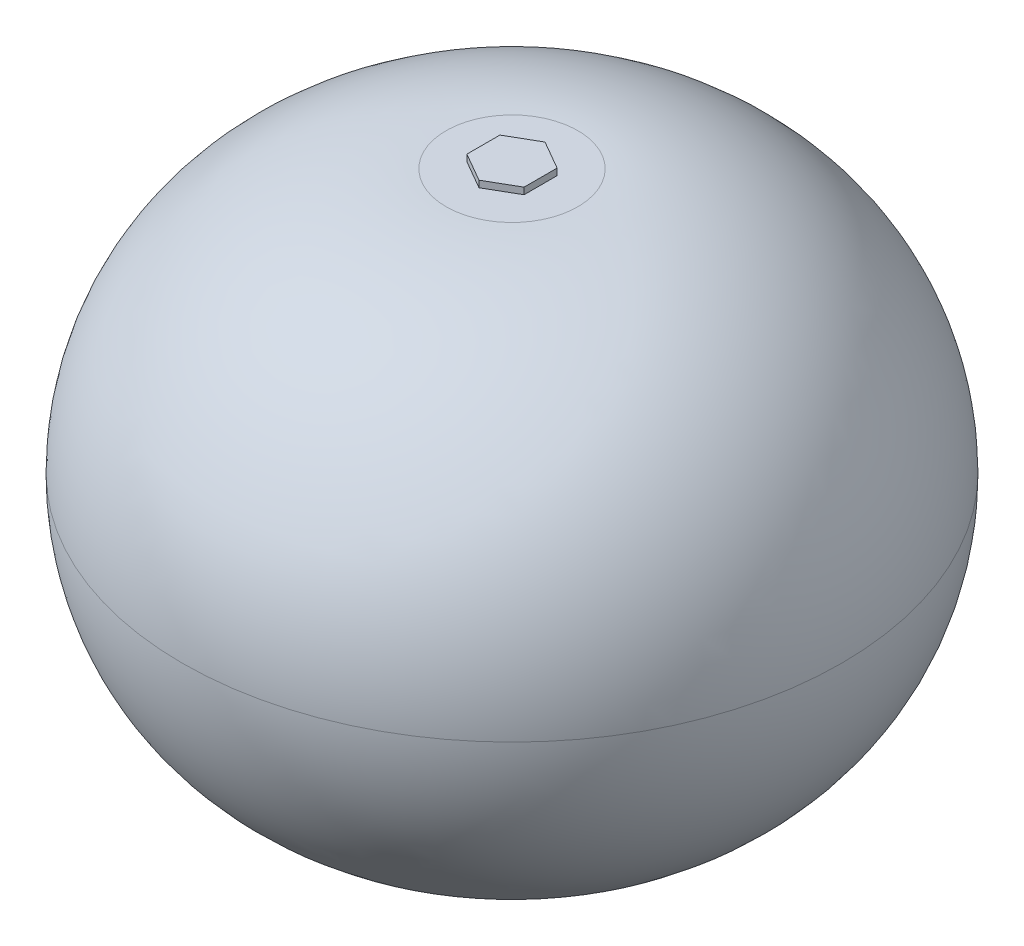
ISO-10303-21;
HEADER;
FILE_DESCRIPTION(('STEP AP214'),'2;1');
FILE_NAME('part.step','',(''),(''),'','','');
FILE_SCHEMA(('AUTOMOTIVE_DESIGN { 1 0 10303 214 1 1 1 1 }'));
ENDSEC;
DATA;
#1=APPLICATION_CONTEXT('core data for automotive mechanical design processes');
#2=APPLICATION_PROTOCOL_DEFINITION('international standard','automotive_design',2000,#1);
#3=PRODUCT_CONTEXT('',#1,'mechanical');
#4=PRODUCT('Part','Part','',(#3));
#5=PRODUCT_RELATED_PRODUCT_CATEGORY('part','',(#4));
#6=PRODUCT_DEFINITION_FORMATION('','',#4);
#7=PRODUCT_DEFINITION_CONTEXT('part definition',#1,'design');
#8=PRODUCT_DEFINITION('design','',#6,#7);
#9=PRODUCT_DEFINITION_SHAPE('','',#8);
#10=(LENGTH_UNIT() NAMED_UNIT(*) SI_UNIT(.MILLI.,.METRE.));
#11=(NAMED_UNIT(*) PLANE_ANGLE_UNIT() SI_UNIT($,.RADIAN.));
#12=(NAMED_UNIT(*) SI_UNIT($,.STERADIAN.) SOLID_ANGLE_UNIT());
#13=UNCERTAINTY_MEASURE_WITH_UNIT(LENGTH_MEASURE(1.E-05),#10,'distance_accuracy_value','');
#14=(GEOMETRIC_REPRESENTATION_CONTEXT(3) GLOBAL_UNCERTAINTY_ASSIGNED_CONTEXT((#13)) GLOBAL_UNIT_ASSIGNED_CONTEXT((#10,
#11,#12)) REPRESENTATION_CONTEXT('',''));
#15=CARTESIAN_POINT('',(0.,0.,0.));
#16=DIRECTION('',(0.,0.,1.));
#17=DIRECTION('',(1.,0.,0.));
#18=AXIS2_PLACEMENT_3D('',#15,#16,#17);
#19=CARTESIAN_POINT('',(0.,20.,0.));
#20=DIRECTION('',(0.,1.,0.));
#21=DIRECTION('',(0.,0.,1.));
#22=AXIS2_PLACEMENT_3D('',#19,#20,#21);
#23=PLANE('',#22);
#24=CARTESIAN_POINT('',(0.,20.,0.));
#25=DIRECTION('',(0.,1.,0.));
#26=DIRECTION('',(0.,0.,1.));
#27=AXIS2_PLACEMENT_3D('',#24,#25,#26);
#28=CIRCLE('',#27,5.);
#29=CARTESIAN_POINT('',(0.,20.,5.));
#30=VERTEX_POINT('',#29);
#31=EDGE_CURVE('E11',#30,#30,#28,.T.);
#32=ORIENTED_EDGE('',*,*,#31,.T.);
#33=EDGE_LOOP('',(#32));
#34=FACE_BOUND('',#33,.T.);
#35=DIRECTION('',(-0.866025403784438,0.,0.500000000000001));
#36=VECTOR('',#35,1.);
#37=CARTESIAN_POINT('',(0.,20.,-2.50482199187729));
#38=LINE('',#37,#36);
#39=CARTESIAN_POINT('',(0.,20.,-2.50482199187729));
#40=VERTEX_POINT('',#39);
#41=CARTESIAN_POINT('',(-2.16923947692368,20.,-1.25241099593864));
#42=VERTEX_POINT('',#41);
#43=EDGE_CURVE('E133',#40,#42,#38,.T.);
#44=ORIENTED_EDGE('',*,*,#43,.F.);
#45=DIRECTION('',(-0.866025403784441,0.,-0.499999999999995));
#46=VECTOR('',#45,1.);
#47=CARTESIAN_POINT('',(2.16923947692366,20.,-1.25241099593867));
#48=LINE('',#47,#46);
#49=CARTESIAN_POINT('',(2.16923947692366,20.,-1.25241099593867));
#50=VERTEX_POINT('',#49);
#51=EDGE_CURVE('E129',#50,#40,#48,.T.);
#52=ORIENTED_EDGE('',*,*,#51,.F.);
#53=DIRECTION('',(0.,0.,-1.));
#54=VECTOR('',#53,1.);
#55=CARTESIAN_POINT('',(2.16923947692369,20.,1.25241099593863));
#56=LINE('',#55,#54);
#57=CARTESIAN_POINT('',(2.16923947692369,20.,1.25241099593863));
#58=VERTEX_POINT('',#57);
#59=EDGE_CURVE('E84',#58,#50,#56,.T.);
#60=ORIENTED_EDGE('',*,*,#59,.F.);
#61=DIRECTION('',(0.866025403784435,0.,-0.500000000000007));
#62=VECTOR('',#61,1.);
#63=CARTESIAN_POINT('',(0.,20.,2.50482199187729));
#64=LINE('',#63,#62);
#65=CARTESIAN_POINT('',(0.,20.,2.50482199187729));
#66=VERTEX_POINT('',#65);
#67=EDGE_CURVE('E141',#66,#58,#64,.T.);
#68=ORIENTED_EDGE('',*,*,#67,.F.);
#69=DIRECTION('',(0.866025403784442,0.,0.499999999999995));
#70=VECTOR('',#69,1.);
#71=CARTESIAN_POINT('',(-2.16923947692367,20.,1.25241099593866));
#72=LINE('',#71,#70);
#73=CARTESIAN_POINT('',(-2.16923947692367,20.,1.25241099593866));
#74=VERTEX_POINT('',#73);
#75=EDGE_CURVE('E115',#74,#66,#72,.T.);
#76=ORIENTED_EDGE('',*,*,#75,.F.);
#77=DIRECTION('',(0.,0.,1.));
#78=VECTOR('',#77,1.);
#79=CARTESIAN_POINT('',(-2.16923947692368,20.,-1.25241099593864));
#80=LINE('',#79,#78);
#81=EDGE_CURVE('E136',#42,#74,#80,.T.);
#82=ORIENTED_EDGE('',*,*,#81,.F.);
#83=EDGE_LOOP('',(#44,#52,#60,#68,#76,#82));
#84=FACE_BOUND('',#83,.T.);
#85=ADVANCED_FACE('F39',(#34,#84),#23,.T.);
#86=CARTESIAN_POINT('',(0.,-20.,0.));
#87=DIRECTION('',(0.,1.,0.));
#88=DIRECTION('',(0.,0.,1.));
#89=AXIS2_PLACEMENT_3D('',#86,#87,#88);
#90=PLANE('',#89);
#91=CARTESIAN_POINT('',(0.,-20.,0.));
#92=DIRECTION('',(0.,1.,0.));
#93=DIRECTION('',(0.,0.,1.));
#94=AXIS2_PLACEMENT_3D('',#91,#92,#93);
#95=CIRCLE('',#94,5.);
#96=CARTESIAN_POINT('',(0.,-20.,5.));
#97=VERTEX_POINT('',#96);
#98=EDGE_CURVE('E49',#97,#97,#95,.F.);
#99=ORIENTED_EDGE('',*,*,#98,.T.);
#100=EDGE_LOOP('',(#99));
#101=FACE_BOUND('',#100,.T.);
#102=ADVANCED_FACE('F171',(#101),#90,.F.);
#103=CARTESIAN_POINT('',(0.,0.,0.));
#104=DIRECTION('',(0.,1.,0.));
#105=DIRECTION('',(0.,0.,1.));
#106=AXIS2_PLACEMENT_3D('',#103,#104,#105);
#107=DEGENERATE_TOROIDAL_SURFACE('',#106,5.,20.,.T.);
#108=ORIENTED_EDGE('',*,*,#31,.F.);
#109=EDGE_LOOP('',(#108));
#110=FACE_BOUND('',#109,.T.);
#111=CARTESIAN_POINT('',(0.,0.,0.));
#112=DIRECTION('',(0.,1.,0.));
#113=DIRECTION('',(0.,0.,1.));
#114=AXIS2_PLACEMENT_3D('',#111,#112,#113);
#115=CIRCLE('',#114,25.);
#116=CARTESIAN_POINT('',(0.,0.,25.));
#117=VERTEX_POINT('',#116);
#118=EDGE_CURVE('E43',#117,#117,#115,.F.);
#119=ORIENTED_EDGE('',*,*,#118,.F.);
#120=EDGE_LOOP('',(#119));
#121=FACE_BOUND('',#120,.T.);
#122=ADVANCED_FACE('F41',(#110,#121),#107,.T.);
#123=CARTESIAN_POINT('',(0.,0.,0.));
#124=DIRECTION('',(0.,1.,0.));
#125=DIRECTION('',(0.,0.,1.));
#126=AXIS2_PLACEMENT_3D('',#123,#124,#125);
#127=DEGENERATE_TOROIDAL_SURFACE('',#126,5.,20.,.T.);
#128=ORIENTED_EDGE('',*,*,#98,.F.);
#129=EDGE_LOOP('',(#128));
#130=FACE_BOUND('',#129,.T.);
#131=ORIENTED_EDGE('',*,*,#118,.T.);
#132=EDGE_LOOP('',(#131));
#133=FACE_BOUND('',#132,.T.);
#134=ADVANCED_FACE('F168',(#130,#133),#127,.T.);
#135=CARTESIAN_POINT('',(2.16923947692366,20.5,-1.25241099593867));
#136=DIRECTION('',(-0.499999999999995,0.,0.866025403784441));
#137=DIRECTION('',(0.866025403784442,0.,0.499999999999995));
#138=AXIS2_PLACEMENT_3D('',#135,#136,#137);
#139=PLANE('',#138);
#140=ORIENTED_EDGE('',*,*,#51,.T.);
#141=DIRECTION('',(0.,-1.,0.));
#142=VECTOR('',#141,1.);
#143=CARTESIAN_POINT('',(0.,20.5,-2.50482199187729));
#144=LINE('',#143,#142);
#145=CARTESIAN_POINT('',(0.,20.5,-2.50482199187729));
#146=VERTEX_POINT('',#145);
#147=EDGE_CURVE('E157',#146,#40,#144,.T.);
#148=ORIENTED_EDGE('',*,*,#147,.F.);
#149=DIRECTION('',(-0.866025403784441,0.,-0.499999999999995));
#150=VECTOR('',#149,1.);
#151=CARTESIAN_POINT('',(2.16923947692366,20.5,-1.25241099593867));
#152=LINE('',#151,#150);
#153=CARTESIAN_POINT('',(2.16923947692366,20.5,-1.25241099593867));
#154=VERTEX_POINT('',#153);
#155=EDGE_CURVE('E146',#154,#146,#152,.T.);
#156=ORIENTED_EDGE('',*,*,#155,.F.);
#157=DIRECTION('',(0.,-1.,0.));
#158=VECTOR('',#157,1.);
#159=CARTESIAN_POINT('',(2.16923947692366,20.5,-1.25241099593867));
#160=LINE('',#159,#158);
#161=EDGE_CURVE('E125',#154,#50,#160,.T.);
#162=ORIENTED_EDGE('',*,*,#161,.T.);
#163=EDGE_LOOP('',(#140,#148,#156,#162));
#164=FACE_BOUND('',#163,.T.);
#165=ADVANCED_FACE('F177',(#164),#139,.F.);
#166=CARTESIAN_POINT('',(0.,20.5,-2.50482199187729));
#167=DIRECTION('',(0.500000000000001,0.,0.866025403784438));
#168=DIRECTION('',(0.866025403784438,0.,-0.500000000000001));
#169=AXIS2_PLACEMENT_3D('',#166,#167,#168);
#170=PLANE('',#169);
#171=ORIENTED_EDGE('',*,*,#43,.T.);
#172=DIRECTION('',(0.,-1.,0.));
#173=VECTOR('',#172,1.);
#174=CARTESIAN_POINT('',(-2.16923947692368,20.5,-1.25241099593864));
#175=LINE('',#174,#173);
#176=CARTESIAN_POINT('',(-2.16923947692368,20.5,-1.25241099593864));
#177=VERTEX_POINT('',#176);
#178=EDGE_CURVE('E153',#177,#42,#175,.T.);
#179=ORIENTED_EDGE('',*,*,#178,.F.);
#180=DIRECTION('',(-0.866025403784438,0.,0.500000000000001));
#181=VECTOR('',#180,1.);
#182=CARTESIAN_POINT('',(0.,20.5,-2.50482199187729));
#183=LINE('',#182,#181);
#184=EDGE_CURVE('E92',#146,#177,#183,.T.);
#185=ORIENTED_EDGE('',*,*,#184,.F.);
#186=ORIENTED_EDGE('',*,*,#147,.T.);
#187=EDGE_LOOP('',(#171,#179,#185,#186));
#188=FACE_BOUND('',#187,.T.);
#189=ADVANCED_FACE('F192',(#188),#170,.F.);
#190=CARTESIAN_POINT('',(-2.16923947692368,20.5,-1.25241099593864));
#191=DIRECTION('',(1.,0.,0.));
#192=DIRECTION('',(0.,0.,-1.));
#193=AXIS2_PLACEMENT_3D('',#190,#191,#192);
#194=PLANE('',#193);
#195=ORIENTED_EDGE('',*,*,#81,.T.);
#196=DIRECTION('',(0.,-1.,0.));
#197=VECTOR('',#196,1.);
#198=CARTESIAN_POINT('',(-2.16923947692367,20.5,1.25241099593866));
#199=LINE('',#198,#197);
#200=CARTESIAN_POINT('',(-2.16923947692367,20.5,1.25241099593866));
#201=VERTEX_POINT('',#200);
#202=EDGE_CURVE('E119',#201,#74,#199,.T.);
#203=ORIENTED_EDGE('',*,*,#202,.F.);
#204=DIRECTION('',(0.,0.,1.));
#205=VECTOR('',#204,1.);
#206=CARTESIAN_POINT('',(-2.16923947692368,20.5,-1.25241099593864));
#207=LINE('',#206,#205);
#208=EDGE_CURVE('E105',#177,#201,#207,.T.);
#209=ORIENTED_EDGE('',*,*,#208,.F.);
#210=ORIENTED_EDGE('',*,*,#178,.T.);
#211=EDGE_LOOP('',(#195,#203,#209,#210));
#212=FACE_BOUND('',#211,.T.);
#213=ADVANCED_FACE('F196',(#212),#194,.F.);
#214=CARTESIAN_POINT('',(-2.16923947692367,20.5,1.25241099593866));
#215=DIRECTION('',(0.499999999999995,0.,-0.866025403784442));
#216=DIRECTION('',(-0.866025403784442,0.,-0.499999999999995));
#217=AXIS2_PLACEMENT_3D('',#214,#215,#216);
#218=PLANE('',#217);
#219=ORIENTED_EDGE('',*,*,#75,.T.);
#220=DIRECTION('',(0.,-1.,0.));
#221=VECTOR('',#220,1.);
#222=CARTESIAN_POINT('',(0.,20.5,2.50482199187729));
#223=LINE('',#222,#221);
#224=CARTESIAN_POINT('',(0.,20.5,2.50482199187729));
#225=VERTEX_POINT('',#224);
#226=EDGE_CURVE('E112',#225,#66,#223,.T.);
#227=ORIENTED_EDGE('',*,*,#226,.F.);
#228=DIRECTION('',(0.866025403784442,0.,0.499999999999995));
#229=VECTOR('',#228,1.);
#230=CARTESIAN_POINT('',(-2.16923947692367,20.5,1.25241099593866));
#231=LINE('',#230,#229);
#232=EDGE_CURVE('E99',#201,#225,#231,.T.);
#233=ORIENTED_EDGE('',*,*,#232,.F.);
#234=ORIENTED_EDGE('',*,*,#202,.T.);
#235=EDGE_LOOP('',(#219,#227,#233,#234));
#236=FACE_BOUND('',#235,.T.);
#237=ADVANCED_FACE('F113',(#236),#218,.F.);
#238=CARTESIAN_POINT('',(0.,20.5,2.50482199187729));
#239=DIRECTION('',(-0.500000000000007,0.,-0.866025403784435));
#240=DIRECTION('',(-0.866025403784435,0.,0.500000000000007));
#241=AXIS2_PLACEMENT_3D('',#238,#239,#240);
#242=PLANE('',#241);
#243=ORIENTED_EDGE('',*,*,#67,.T.);
#244=DIRECTION('',(0.,-1.,0.));
#245=VECTOR('',#244,1.);
#246=CARTESIAN_POINT('',(2.16923947692369,20.5,1.25241099593863));
#247=LINE('',#246,#245);
#248=CARTESIAN_POINT('',(2.16923947692369,20.5,1.25241099593863));
#249=VERTEX_POINT('',#248);
#250=EDGE_CURVE('E56',#249,#58,#247,.T.);
#251=ORIENTED_EDGE('',*,*,#250,.F.);
#252=DIRECTION('',(0.866025403784435,0.,-0.500000000000007));
#253=VECTOR('',#252,1.);
#254=CARTESIAN_POINT('',(0.,20.5,2.50482199187729));
#255=LINE('',#254,#253);
#256=EDGE_CURVE('E103',#225,#249,#255,.T.);
#257=ORIENTED_EDGE('',*,*,#256,.F.);
#258=ORIENTED_EDGE('',*,*,#226,.T.);
#259=EDGE_LOOP('',(#243,#251,#257,#258));
#260=FACE_BOUND('',#259,.T.);
#261=ADVANCED_FACE('F121',(#260),#242,.F.);
#262=CARTESIAN_POINT('',(2.16923947692369,20.5,1.25241099593863));
#263=DIRECTION('',(-1.,0.,0.));
#264=DIRECTION('',(0.,0.,1.));
#265=AXIS2_PLACEMENT_3D('',#262,#263,#264);
#266=PLANE('',#265);
#267=ORIENTED_EDGE('',*,*,#59,.T.);
#268=ORIENTED_EDGE('',*,*,#161,.F.);
#269=DIRECTION('',(0.,0.,-1.));
#270=VECTOR('',#269,1.);
#271=CARTESIAN_POINT('',(2.16923947692369,20.5,1.25241099593863));
#272=LINE('',#271,#270);
#273=EDGE_CURVE('E64',#249,#154,#272,.T.);
#274=ORIENTED_EDGE('',*,*,#273,.F.);
#275=ORIENTED_EDGE('',*,*,#250,.T.);
#276=EDGE_LOOP('',(#267,#268,#274,#275));
#277=FACE_BOUND('',#276,.T.);
#278=ADVANCED_FACE('F204',(#277),#266,.F.);
#279=CARTESIAN_POINT('',(0.,20.5,0.));
#280=DIRECTION('',(0.,1.,0.));
#281=DIRECTION('',(0.,0.,1.));
#282=AXIS2_PLACEMENT_3D('',#279,#280,#281);
#283=PLANE('',#282);
#284=ORIENTED_EDGE('',*,*,#155,.T.);
#285=ORIENTED_EDGE('',*,*,#184,.T.);
#286=ORIENTED_EDGE('',*,*,#208,.T.);
#287=ORIENTED_EDGE('',*,*,#232,.T.);
#288=ORIENTED_EDGE('',*,*,#256,.T.);
#289=ORIENTED_EDGE('',*,*,#273,.T.);
#290=EDGE_LOOP('',(#284,#285,#286,#287,#288,#289));
#291=FACE_BOUND('',#290,.T.);
#292=ADVANCED_FACE('F101',(#291),#283,.T.);
#293=CLOSED_SHELL('',(#85,#102,#122,#134,#165,#189,#213,#237,#261,#278,#292));
#294=MANIFOLD_SOLID_BREP('B2',#293);
#295=ADVANCED_BREP_SHAPE_REPRESENTATION('',(#18,#294),#14);
#296=SHAPE_DEFINITION_REPRESENTATION(#9,#295);
ENDSEC;
END-ISO-10303-21;
